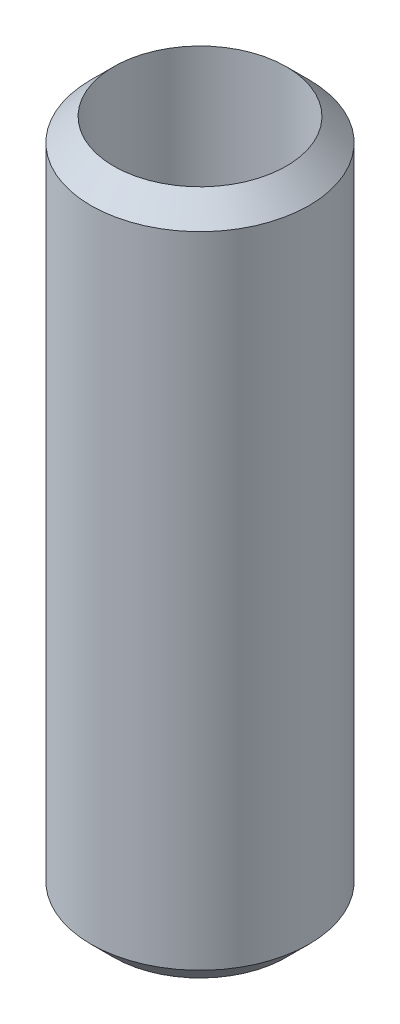
ISO-10303-21;
HEADER;
FILE_DESCRIPTION(('STEP AP214'),'2;1');
FILE_NAME('part.step','',(''),(''),'','','');
FILE_SCHEMA(('AUTOMOTIVE_DESIGN { 1 0 10303 214 1 1 1 1 }'));
ENDSEC;
DATA;
#1=APPLICATION_CONTEXT('core data for automotive mechanical design processes');
#2=APPLICATION_PROTOCOL_DEFINITION('international standard','automotive_design',2000,#1);
#3=PRODUCT_CONTEXT('',#1,'mechanical');
#4=PRODUCT('Part','Part','',(#3));
#5=PRODUCT_RELATED_PRODUCT_CATEGORY('part','',(#4));
#6=PRODUCT_DEFINITION_FORMATION('','',#4);
#7=PRODUCT_DEFINITION_CONTEXT('part definition',#1,'design');
#8=PRODUCT_DEFINITION('design','',#6,#7);
#9=PRODUCT_DEFINITION_SHAPE('','',#8);
#10=(LENGTH_UNIT() NAMED_UNIT(*) SI_UNIT(.MILLI.,.METRE.));
#11=(NAMED_UNIT(*) PLANE_ANGLE_UNIT() SI_UNIT($,.RADIAN.));
#12=(NAMED_UNIT(*) SI_UNIT($,.STERADIAN.) SOLID_ANGLE_UNIT());
#13=UNCERTAINTY_MEASURE_WITH_UNIT(LENGTH_MEASURE(1.E-05),#10,'distance_accuracy_value','');
#14=(GEOMETRIC_REPRESENTATION_CONTEXT(3) GLOBAL_UNCERTAINTY_ASSIGNED_CONTEXT((#13)) GLOBAL_UNIT_ASSIGNED_CONTEXT((#10,
#11,#12)) REPRESENTATION_CONTEXT('',''));
#15=CARTESIAN_POINT('',(0.,0.,0.));
#16=DIRECTION('',(0.,0.,1.));
#17=DIRECTION('',(1.,0.,0.));
#18=AXIS2_PLACEMENT_3D('',#15,#16,#17);
#19=CARTESIAN_POINT('',(0.,141.739806160291,0.));
#20=DIRECTION('',(0.,-1.,0.));
#21=DIRECTION('',(0.,0.,-1.));
#22=AXIS2_PLACEMENT_3D('',#19,#20,#21);
#23=CYLINDRICAL_SURFACE('',#22,22.5);
#24=CARTESIAN_POINT('',(0.,136.882161679764,0.));
#25=DIRECTION('',(0.,1.,0.));
#26=DIRECTION('',(0.,0.,1.));
#27=AXIS2_PLACEMENT_3D('',#24,#25,#26);
#28=CIRCLE('',#27,22.5);
#29=CARTESIAN_POINT('',(0.,136.882161679764,22.5));
#30=VERTEX_POINT('',#29);
#31=EDGE_CURVE('E10',#30,#30,#28,.F.);
#32=ORIENTED_EDGE('',*,*,#31,.T.);
#33=EDGE_LOOP('',(#32));
#34=FACE_BOUND('',#33,.T.);
#35=CARTESIAN_POINT('',(0.,4.85764448052725,0.));
#36=DIRECTION('',(0.,1.,0.));
#37=DIRECTION('',(0.,0.,1.));
#38=AXIS2_PLACEMENT_3D('',#35,#36,#37);
#39=CIRCLE('',#38,22.5);
#40=CARTESIAN_POINT('',(0.,4.85764448052725,22.5));
#41=VERTEX_POINT('',#40);
#42=EDGE_CURVE('E50',#41,#41,#39,.T.);
#43=ORIENTED_EDGE('',*,*,#42,.T.);
#44=EDGE_LOOP('',(#43));
#45=FACE_BOUND('',#44,.T.);
#46=ADVANCED_FACE('F39',(#34,#45),#23,.T.);
#47=CARTESIAN_POINT('',(0.,141.739806160291,0.));
#48=DIRECTION('',(0.,-1.,0.));
#49=DIRECTION('',(0.,0.,-1.));
#50=AXIS2_PLACEMENT_3D('',#47,#48,#49);
#51=CYLINDRICAL_SURFACE('',#50,17.8036137234619);
#52=CARTESIAN_POINT('',(0.,141.578547956302,0.));
#53=DIRECTION('',(0.,-1.,0.));
#54=DIRECTION('',(0.,0.,-1.));
#55=AXIS2_PLACEMENT_3D('',#52,#53,#54);
#56=CIRCLE('',#55,17.8036137234619);
#57=CARTESIAN_POINT('',(0.,141.578547956302,-17.8036137234619));
#58=VERTEX_POINT('',#57);
#59=EDGE_CURVE('E51',#58,#58,#56,.F.);
#60=ORIENTED_EDGE('',*,*,#59,.T.);
#61=EDGE_LOOP('',(#60));
#62=FACE_BOUND('',#61,.T.);
#63=CARTESIAN_POINT('',(0.,0.161258203989082,0.));
#64=DIRECTION('',(0.,1.,0.));
#65=DIRECTION('',(0.,0.,1.));
#66=AXIS2_PLACEMENT_3D('',#63,#64,#65);
#67=CIRCLE('',#66,17.8036137234619);
#68=CARTESIAN_POINT('',(0.,0.161258203989082,17.8036137234619));
#69=VERTEX_POINT('',#68);
#70=EDGE_CURVE('E54',#69,#69,#67,.F.);
#71=ORIENTED_EDGE('',*,*,#70,.T.);
#72=EDGE_LOOP('',(#71));
#73=FACE_BOUND('',#72,.T.);
#74=ADVANCED_FACE('F63',(#62,#73),#51,.F.);
#75=CARTESIAN_POINT('',(0.,141.739806160291,0.));
#76=DIRECTION('',(0.,-1.,0.));
#77=DIRECTION('',(0.,0.,-1.));
#78=AXIS2_PLACEMENT_3D('',#75,#76,#77);
#79=CONICAL_SURFACE('',#78,17.6423555194728,0.785398163397451);
#80=ORIENTED_EDGE('',*,*,#31,.F.);
#81=EDGE_LOOP('',(#80));
#82=FACE_BOUND('',#81,.T.);
#83=ORIENTED_EDGE('',*,*,#59,.F.);
#84=EDGE_LOOP('',(#83));
#85=FACE_BOUND('',#84,.T.);
#86=ADVANCED_FACE('F64',(#82,#85),#79,.T.);
#87=CARTESIAN_POINT('',(0.,4.85764448052725,0.));
#88=DIRECTION('',(0.,1.,0.));
#89=DIRECTION('',(0.,0.,1.));
#90=AXIS2_PLACEMENT_3D('',#87,#88,#89);
#91=CONICAL_SURFACE('',#90,22.5,0.785398163397445);
#92=ORIENTED_EDGE('',*,*,#70,.F.);
#93=EDGE_LOOP('',(#92));
#94=FACE_BOUND('',#93,.T.);
#95=ORIENTED_EDGE('',*,*,#42,.F.);
#96=EDGE_LOOP('',(#95));
#97=FACE_BOUND('',#96,.T.);
#98=ADVANCED_FACE('F45',(#94,#97),#91,.T.);
#99=CLOSED_SHELL('',(#46,#74,#86,#98));
#100=MANIFOLD_SOLID_BREP('B2',#99);
#101=ADVANCED_BREP_SHAPE_REPRESENTATION('',(#18,#100),#14);
#102=SHAPE_DEFINITION_REPRESENTATION(#9,#101);
ENDSEC;
END-ISO-10303-21;
